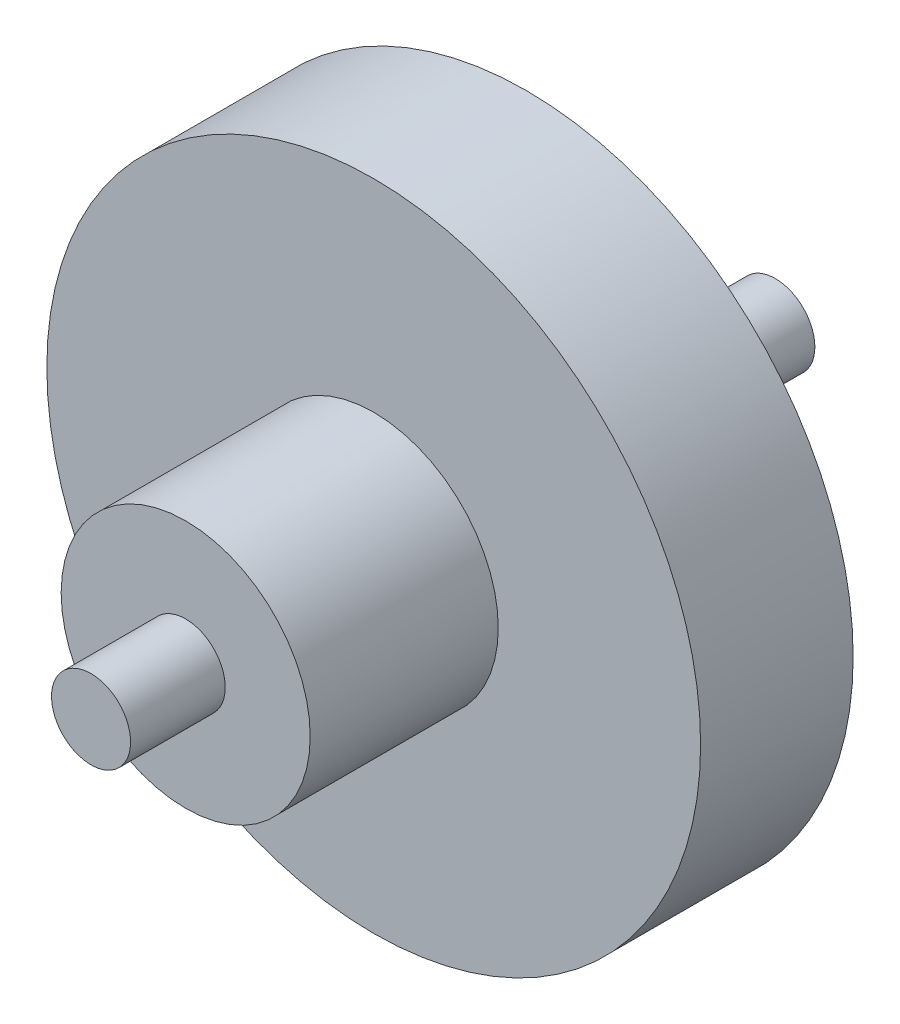
ISO-10303-21;
HEADER;
FILE_DESCRIPTION(('STEP AP214'),'2;1');
FILE_NAME('part.step','',(''),(''),'','','');
FILE_SCHEMA(('AUTOMOTIVE_DESIGN { 1 0 10303 214 1 1 1 1 }'));
ENDSEC;
DATA;
#1=APPLICATION_CONTEXT('core data for automotive mechanical design processes');
#2=APPLICATION_PROTOCOL_DEFINITION('international standard','automotive_design',2000,#1);
#3=PRODUCT_CONTEXT('',#1,'mechanical');
#4=PRODUCT('Part','Part','',(#3));
#5=PRODUCT_RELATED_PRODUCT_CATEGORY('part','',(#4));
#6=PRODUCT_DEFINITION_FORMATION('','',#4);
#7=PRODUCT_DEFINITION_CONTEXT('part definition',#1,'design');
#8=PRODUCT_DEFINITION('design','',#6,#7);
#9=PRODUCT_DEFINITION_SHAPE('','',#8);
#10=(LENGTH_UNIT() NAMED_UNIT(*) SI_UNIT(.MILLI.,.METRE.));
#11=(NAMED_UNIT(*) PLANE_ANGLE_UNIT() SI_UNIT($,.RADIAN.));
#12=(NAMED_UNIT(*) SI_UNIT($,.STERADIAN.) SOLID_ANGLE_UNIT());
#13=UNCERTAINTY_MEASURE_WITH_UNIT(LENGTH_MEASURE(1.E-05),#10,'distance_accuracy_value','');
#14=(GEOMETRIC_REPRESENTATION_CONTEXT(3) GLOBAL_UNCERTAINTY_ASSIGNED_CONTEXT((#13)) GLOBAL_UNIT_ASSIGNED_CONTEXT((#10,
#11,#12)) REPRESENTATION_CONTEXT('',''));
#15=CARTESIAN_POINT('',(0.,0.,0.));
#16=DIRECTION('',(0.,0.,1.));
#17=DIRECTION('',(1.,0.,0.));
#18=AXIS2_PLACEMENT_3D('',#15,#16,#17);
#19=CARTESIAN_POINT('',(-0.32131,-0.32131,3.495));
#20=DIRECTION('',(0.,0.,1.));
#21=DIRECTION('',(1.,0.,0.));
#22=AXIS2_PLACEMENT_3D('',#19,#20,#21);
#23=PLANE('',#22);
#24=CARTESIAN_POINT('',(0.,0.,3.495));
#25=DIRECTION('',(0.,0.,-1.));
#26=DIRECTION('',(0.,1.,0.));
#27=AXIS2_PLACEMENT_3D('',#24,#25,#26);
#28=CIRCLE('',#27,0.3175);
#29=CARTESIAN_POINT('',(0.,0.3175,3.495));
#30=VERTEX_POINT('',#29);
#31=EDGE_CURVE('E19',#30,#30,#28,.F.);
#32=ORIENTED_EDGE('',*,*,#31,.T.);
#33=EDGE_LOOP('',(#32));
#34=FACE_BOUND('',#33,.T.);
#35=ADVANCED_FACE('F15',(#34),#23,.T.);
#36=CARTESIAN_POINT('',(0.,0.,3.495));
#37=DIRECTION('',(0.,0.,-1.));
#38=DIRECTION('',(0.,1.,0.));
#39=AXIS2_PLACEMENT_3D('',#36,#37,#38);
#40=CYLINDRICAL_SURFACE('',#39,0.3175);
#41=CARTESIAN_POINT('',(0.,0.,2.735));
#42=DIRECTION('',(0.,0.,-1.));
#43=DIRECTION('',(0.,1.,0.));
#44=AXIS2_PLACEMENT_3D('',#41,#42,#43);
#45=CIRCLE('',#44,0.3175);
#46=CARTESIAN_POINT('',(0.,0.3175,2.735));
#47=VERTEX_POINT('',#46);
#48=EDGE_CURVE('E41',#47,#47,#45,.T.);
#49=ORIENTED_EDGE('',*,*,#48,.F.);
#50=EDGE_LOOP('',(#49));
#51=FACE_BOUND('',#50,.T.);
#52=ORIENTED_EDGE('',*,*,#31,.F.);
#53=EDGE_LOOP('',(#52));
#54=FACE_BOUND('',#53,.T.);
#55=ADVANCED_FACE('F49',(#51,#54),#40,.T.);
#56=CARTESIAN_POINT('',(-1.012,-1.012,2.735));
#57=DIRECTION('',(0.,0.,1.));
#58=DIRECTION('',(1.,0.,0.));
#59=AXIS2_PLACEMENT_3D('',#56,#57,#58);
#60=PLANE('',#59);
#61=ORIENTED_EDGE('',*,*,#48,.T.);
#62=EDGE_LOOP('',(#61));
#63=FACE_BOUND('',#62,.T.);
#64=CARTESIAN_POINT('',(0.,0.,2.735));
#65=DIRECTION('',(0.,0.,-1.));
#66=DIRECTION('',(-1.,0.,0.));
#67=AXIS2_PLACEMENT_3D('',#64,#65,#66);
#68=CIRCLE('',#67,1.);
#69=CARTESIAN_POINT('',(-1.,0.,2.735));
#70=VERTEX_POINT('',#69);
#71=EDGE_CURVE('E39',#70,#70,#68,.F.);
#72=ORIENTED_EDGE('',*,*,#71,.T.);
#73=EDGE_LOOP('',(#72));
#74=FACE_BOUND('',#73,.T.);
#75=ADVANCED_FACE('F51',(#63,#74),#60,.T.);
#76=CARTESIAN_POINT('',(0.,0.,2.735));
#77=DIRECTION('',(0.,0.,-1.));
#78=DIRECTION('',(-1.,0.,0.));
#79=AXIS2_PLACEMENT_3D('',#76,#77,#78);
#80=CYLINDRICAL_SURFACE('',#79,1.);
#81=CARTESIAN_POINT('',(0.,0.,1.225));
#82=DIRECTION('',(0.,0.,-1.));
#83=DIRECTION('',(-1.,0.,0.));
#84=AXIS2_PLACEMENT_3D('',#81,#82,#83);
#85=CIRCLE('',#84,1.);
#86=CARTESIAN_POINT('',(-1.,0.,1.225));
#87=VERTEX_POINT('',#86);
#88=EDGE_CURVE('E36',#87,#87,#85,.T.);
#89=ORIENTED_EDGE('',*,*,#88,.F.);
#90=EDGE_LOOP('',(#89));
#91=FACE_BOUND('',#90,.T.);
#92=ORIENTED_EDGE('',*,*,#71,.F.);
#93=EDGE_LOOP('',(#92));
#94=FACE_BOUND('',#93,.T.);
#95=ADVANCED_FACE('F59',(#91,#94),#80,.T.);
#96=CARTESIAN_POINT('',(-2.6565,-2.6565,1.225));
#97=DIRECTION('',(0.,0.,1.));
#98=DIRECTION('',(1.,0.,0.));
#99=AXIS2_PLACEMENT_3D('',#96,#97,#98);
#100=PLANE('',#99);
#101=ORIENTED_EDGE('',*,*,#88,.T.);
#102=EDGE_LOOP('',(#101));
#103=FACE_BOUND('',#102,.T.);
#104=CARTESIAN_POINT('',(0.,0.,1.225));
#105=DIRECTION('',(0.,0.,-1.));
#106=DIRECTION('',(-1.,0.,0.));
#107=AXIS2_PLACEMENT_3D('',#104,#105,#106);
#108=CIRCLE('',#107,2.625);
#109=CARTESIAN_POINT('',(-2.625,0.,1.225));
#110=VERTEX_POINT('',#109);
#111=EDGE_CURVE('E33',#110,#110,#108,.F.);
#112=ORIENTED_EDGE('',*,*,#111,.T.);
#113=EDGE_LOOP('',(#112));
#114=FACE_BOUND('',#113,.T.);
#115=ADVANCED_FACE('F76',(#103,#114),#100,.T.);
#116=CARTESIAN_POINT('',(0.,0.,1.225));
#117=DIRECTION('',(0.,0.,-1.));
#118=DIRECTION('',(-1.,0.,0.));
#119=AXIS2_PLACEMENT_3D('',#116,#117,#118);
#120=CYLINDRICAL_SURFACE('',#119,2.625);
#121=ORIENTED_EDGE('',*,*,#111,.F.);
#122=EDGE_LOOP('',(#121));
#123=FACE_BOUND('',#122,.T.);
#124=CARTESIAN_POINT('',(0.,0.,0.));
#125=DIRECTION('',(0.,0.,-1.));
#126=DIRECTION('',(-1.,0.,0.));
#127=AXIS2_PLACEMENT_3D('',#124,#125,#126);
#128=CIRCLE('',#127,2.625);
#129=CARTESIAN_POINT('',(-2.625,0.,0.));
#130=VERTEX_POINT('',#129);
#131=EDGE_CURVE('E28',#130,#130,#128,.F.);
#132=ORIENTED_EDGE('',*,*,#131,.T.);
#133=EDGE_LOOP('',(#132));
#134=FACE_BOUND('',#133,.T.);
#135=ADVANCED_FACE('F74',(#123,#134),#120,.T.);
#136=CARTESIAN_POINT('',(-2.6565,-2.6565,0.));
#137=DIRECTION('',(0.,0.,1.));
#138=DIRECTION('',(1.,0.,0.));
#139=AXIS2_PLACEMENT_3D('',#136,#137,#138);
#140=PLANE('',#139);
#141=CARTESIAN_POINT('',(0.,0.,0.));
#142=DIRECTION('',(0.,0.,1.));
#143=DIRECTION('',(1.,0.,0.));
#144=AXIS2_PLACEMENT_3D('',#141,#142,#143);
#145=CIRCLE('',#144,0.3175);
#146=CARTESIAN_POINT('',(0.3175,0.,0.));
#147=VERTEX_POINT('',#146);
#148=EDGE_CURVE('E23',#147,#147,#145,.T.);
#149=ORIENTED_EDGE('',*,*,#148,.T.);
#150=EDGE_LOOP('',(#149));
#151=FACE_BOUND('',#150,.T.);
#152=ORIENTED_EDGE('',*,*,#131,.F.);
#153=EDGE_LOOP('',(#152));
#154=FACE_BOUND('',#153,.T.);
#155=ADVANCED_FACE('F70',(#151,#154),#140,.F.);
#156=CARTESIAN_POINT('',(0.32131,-0.32131,-2.));
#157=DIRECTION('',(0.,0.,-1.));
#158=DIRECTION('',(-1.,0.,0.));
#159=AXIS2_PLACEMENT_3D('',#156,#157,#158);
#160=PLANE('',#159);
#161=CARTESIAN_POINT('',(0.,0.,-2.));
#162=DIRECTION('',(0.,0.,1.));
#163=DIRECTION('',(1.,0.,0.));
#164=AXIS2_PLACEMENT_3D('',#161,#162,#163);
#165=CIRCLE('',#164,0.3175);
#166=CARTESIAN_POINT('',(0.3175,0.,-2.));
#167=VERTEX_POINT('',#166);
#168=EDGE_CURVE('E10',#167,#167,#165,.F.);
#169=ORIENTED_EDGE('',*,*,#168,.T.);
#170=EDGE_LOOP('',(#169));
#171=FACE_BOUND('',#170,.T.);
#172=ADVANCED_FACE('F17',(#171),#160,.T.);
#173=CARTESIAN_POINT('',(0.,0.,-2.));
#174=DIRECTION('',(0.,0.,1.));
#175=DIRECTION('',(1.,0.,0.));
#176=AXIS2_PLACEMENT_3D('',#173,#174,#175);
#177=CYLINDRICAL_SURFACE('',#176,0.3175);
#178=ORIENTED_EDGE('',*,*,#148,.F.);
#179=EDGE_LOOP('',(#178));
#180=FACE_BOUND('',#179,.T.);
#181=ORIENTED_EDGE('',*,*,#168,.F.);
#182=EDGE_LOOP('',(#181));
#183=FACE_BOUND('',#182,.T.);
#184=ADVANCED_FACE('F63',(#180,#183),#177,.T.);
#185=CLOSED_SHELL('',(#35,#55,#75,#95,#115,#135,#155,#172,#184));
#186=MANIFOLD_SOLID_BREP('B1',#185);
#187=ADVANCED_BREP_SHAPE_REPRESENTATION('',(#18,#186),#14);
#188=SHAPE_DEFINITION_REPRESENTATION(#9,#187);
ENDSEC;
END-ISO-10303-21;
